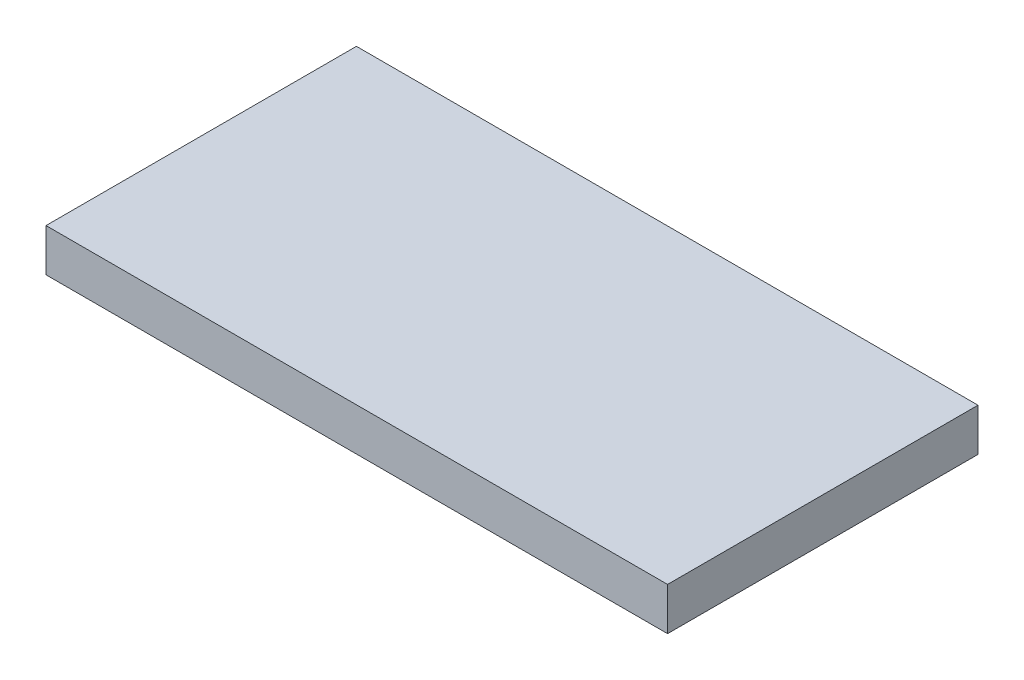
ISO-10303-21;
HEADER;
FILE_DESCRIPTION(('STEP AP214'),'2;1');
FILE_NAME('part.step','',(''),(''),'','','');
FILE_SCHEMA(('AUTOMOTIVE_DESIGN { 1 0 10303 214 1 1 1 1 }'));
ENDSEC;
DATA;
#1=APPLICATION_CONTEXT('core data for automotive mechanical design processes');
#2=APPLICATION_PROTOCOL_DEFINITION('international standard','automotive_design',2000,#1);
#3=PRODUCT_CONTEXT('',#1,'mechanical');
#4=PRODUCT('Part','Part','',(#3));
#5=PRODUCT_RELATED_PRODUCT_CATEGORY('part','',(#4));
#6=PRODUCT_DEFINITION_FORMATION('','',#4);
#7=PRODUCT_DEFINITION_CONTEXT('part definition',#1,'design');
#8=PRODUCT_DEFINITION('design','',#6,#7);
#9=PRODUCT_DEFINITION_SHAPE('','',#8);
#10=(LENGTH_UNIT() NAMED_UNIT(*) SI_UNIT(.MILLI.,.METRE.));
#11=(NAMED_UNIT(*) PLANE_ANGLE_UNIT() SI_UNIT($,.RADIAN.));
#12=(NAMED_UNIT(*) SI_UNIT($,.STERADIAN.) SOLID_ANGLE_UNIT());
#13=UNCERTAINTY_MEASURE_WITH_UNIT(LENGTH_MEASURE(1.E-05),#10,'distance_accuracy_value','');
#14=(GEOMETRIC_REPRESENTATION_CONTEXT(3) GLOBAL_UNCERTAINTY_ASSIGNED_CONTEXT((#13)) GLOBAL_UNIT_ASSIGNED_CONTEXT((#10,
#11,#12)) REPRESENTATION_CONTEXT('',''));
#15=CARTESIAN_POINT('',(0.,0.,0.));
#16=DIRECTION('',(0.,0.,1.));
#17=DIRECTION('',(1.,0.,0.));
#18=AXIS2_PLACEMENT_3D('',#15,#16,#17);
#19=CARTESIAN_POINT('',(0.,0.,0.));
#20=DIRECTION('',(0.,-1.,0.));
#21=DIRECTION('',(0.,0.,-1.));
#22=AXIS2_PLACEMENT_3D('',#19,#20,#21);
#23=PLANE('',#22);
#24=CARTESIAN_POINT('',(8.28039999999996,0.,-17.8562));
#25=DIRECTION('',(0.,-1.,0.));
#26=DIRECTION('',(0.,0.,-1.));
#27=AXIS2_PLACEMENT_3D('',#24,#25,#26);
#28=CIRCLE('',#27,1.0668);
#29=CARTESIAN_POINT('',(8.28039999999996,0.,-18.923));
#30=VERTEX_POINT('',#29);
#31=EDGE_CURVE('E494',#30,#30,#28,.T.);
#32=ORIENTED_EDGE('',*,*,#31,.F.);
#33=EDGE_LOOP('',(#32));
#34=FACE_BOUND('',#33,.T.);
#35=CARTESIAN_POINT('',(179.3875,0.,-10.16));
#36=DIRECTION('',(0.,-1.,0.));
#37=DIRECTION('',(0.,0.,-1.));
#38=AXIS2_PLACEMENT_3D('',#35,#36,#37);
#39=CIRCLE('',#38,1.27000000000003);
#40=CARTESIAN_POINT('',(179.3875,0.,-11.43));
#41=VERTEX_POINT('',#40);
#42=EDGE_CURVE('E284',#41,#41,#39,.T.);
#43=ORIENTED_EDGE('',*,*,#42,.F.);
#44=EDGE_LOOP('',(#43));
#45=FACE_BOUND('',#44,.T.);
#46=CARTESIAN_POINT('',(179.3875,0.,-85.7758));
#47=DIRECTION('',(0.,-1.,0.));
#48=DIRECTION('',(0.,0.,1.));
#49=AXIS2_PLACEMENT_3D('',#46,#47,#48);
#50=CIRCLE('',#49,1.27000000000001);
#51=CARTESIAN_POINT('',(179.3875,0.,-84.5058));
#52=VERTEX_POINT('',#51);
#53=EDGE_CURVE('E288',#52,#52,#50,.T.);
#54=ORIENTED_EDGE('',*,*,#53,.F.);
#55=EDGE_LOOP('',(#54));
#56=FACE_BOUND('',#55,.T.);
#57=CARTESIAN_POINT('',(12.7,0.,-10.16));
#58=DIRECTION('',(0.,-1.,0.));
#59=DIRECTION('',(0.,0.,1.));
#60=AXIS2_PLACEMENT_3D('',#57,#58,#59);
#61=CIRCLE('',#60,1.27000000000001);
#62=CARTESIAN_POINT('',(12.7,0.,-8.88999999999999));
#63=VERTEX_POINT('',#62);
#64=EDGE_CURVE('E294',#63,#63,#61,.T.);
#65=ORIENTED_EDGE('',*,*,#64,.F.);
#66=EDGE_LOOP('',(#65));
#67=FACE_BOUND('',#66,.T.);
#68=CARTESIAN_POINT('',(12.7,0.,-85.7758));
#69=DIRECTION('',(0.,-1.,0.));
#70=DIRECTION('',(0.,0.,-1.));
#71=AXIS2_PLACEMENT_3D('',#68,#69,#70);
#72=CIRCLE('',#71,1.27000000000001);
#73=CARTESIAN_POINT('',(12.7,0.,-87.0458));
#74=VERTEX_POINT('',#73);
#75=EDGE_CURVE('E300',#74,#74,#72,.T.);
#76=ORIENTED_EDGE('',*,*,#75,.F.);
#77=EDGE_LOOP('',(#76));
#78=FACE_BOUND('',#77,.T.);
#79=DIRECTION('',(0.,0.,-1.));
#80=VECTOR('',#79,1.);
#81=CARTESIAN_POINT('',(12.954,0.,-12.954));
#82=LINE('',#81,#80);
#83=CARTESIAN_POINT('',(12.954,0.,-18.034));
#84=VERTEX_POINT('',#83);
#85=CARTESIAN_POINT('',(12.954,0.,-77.9018));
#86=VERTEX_POINT('',#85);
#87=EDGE_CURVE('E306',#84,#86,#82,.T.);
#88=ORIENTED_EDGE('',*,*,#87,.F.);
#89=CARTESIAN_POINT('',(18.034,0.,-18.034));
#90=DIRECTION('',(0.,-1.,0.));
#91=DIRECTION('',(0.,0.,-1.));
#92=AXIS2_PLACEMENT_3D('',#89,#90,#91);
#93=CIRCLE('',#92,5.08);
#94=CARTESIAN_POINT('',(18.034,0.,-12.954));
#95=VERTEX_POINT('',#94);
#96=EDGE_CURVE('E56',#84,#95,#93,.F.);
#97=ORIENTED_EDGE('',*,*,#96,.T.);
#98=DIRECTION('',(-1.,0.,0.));
#99=VECTOR('',#98,1.);
#100=CARTESIAN_POINT('',(12.954,0.,-12.954));
#101=LINE('',#100,#99);
#102=CARTESIAN_POINT('',(174.0535,0.,-12.954));
#103=VERTEX_POINT('',#102);
#104=EDGE_CURVE('E313',#103,#95,#101,.T.);
#105=ORIENTED_EDGE('',*,*,#104,.F.);
#106=CARTESIAN_POINT('',(174.0535,0.,-18.034));
#107=DIRECTION('',(0.,-1.,0.));
#108=DIRECTION('',(0.,0.,-1.));
#109=AXIS2_PLACEMENT_3D('',#106,#107,#108);
#110=CIRCLE('',#109,5.08);
#111=CARTESIAN_POINT('',(179.1335,0.,-18.034));
#112=VERTEX_POINT('',#111);
#113=EDGE_CURVE('E388',#103,#112,#110,.F.);
#114=ORIENTED_EDGE('',*,*,#113,.T.);
#115=DIRECTION('',(0.,0.,1.));
#116=VECTOR('',#115,1.);
#117=CARTESIAN_POINT('',(179.1335,0.,-12.954));
#118=LINE('',#117,#116);
#119=CARTESIAN_POINT('',(179.1335,0.,-77.9018));
#120=VERTEX_POINT('',#119);
#121=EDGE_CURVE('E327',#120,#112,#118,.T.);
#122=ORIENTED_EDGE('',*,*,#121,.F.);
#123=CARTESIAN_POINT('',(174.0535,0.,-77.9018));
#124=DIRECTION('',(0.,-1.,0.));
#125=DIRECTION('',(0.,0.,-1.));
#126=AXIS2_PLACEMENT_3D('',#123,#124,#125);
#127=CIRCLE('',#126,5.08);
#128=CARTESIAN_POINT('',(174.0535,0.,-82.9818));
#129=VERTEX_POINT('',#128);
#130=EDGE_CURVE('E390',#120,#129,#127,.F.);
#131=ORIENTED_EDGE('',*,*,#130,.T.);
#132=DIRECTION('',(1.,0.,0.));
#133=VECTOR('',#132,1.);
#134=CARTESIAN_POINT('',(12.954,0.,-82.9818));
#135=LINE('',#134,#133);
#136=CARTESIAN_POINT('',(18.034,0.,-82.9818));
#137=VERTEX_POINT('',#136);
#138=EDGE_CURVE('E324',#137,#129,#135,.T.);
#139=ORIENTED_EDGE('',*,*,#138,.F.);
#140=CARTESIAN_POINT('',(18.034,0.,-77.9018));
#141=DIRECTION('',(0.,-1.,0.));
#142=DIRECTION('',(0.,0.,-1.));
#143=AXIS2_PLACEMENT_3D('',#140,#141,#142);
#144=CIRCLE('',#143,5.08);
#145=EDGE_CURVE('E48',#137,#86,#144,.F.);
#146=ORIENTED_EDGE('',*,*,#145,.T.);
#147=EDGE_LOOP('',(#88,#97,#105,#114,#122,#131,#139,#146));
#148=FACE_BOUND('',#147,.T.);
#149=DIRECTION('',(0.,0.,1.));
#150=VECTOR('',#149,1.);
#151=CARTESIAN_POINT('',(0.,0.,0.));
#152=LINE('',#151,#150);
#153=CARTESIAN_POINT('',(0.,0.,-95.9358));
#154=VERTEX_POINT('',#153);
#155=CARTESIAN_POINT('',(0.,0.,0.));
#156=VERTEX_POINT('',#155);
#157=EDGE_CURVE('E322',#154,#156,#152,.T.);
#158=ORIENTED_EDGE('',*,*,#157,.F.);
#159=DIRECTION('',(-1.,0.,0.));
#160=VECTOR('',#159,1.);
#161=CARTESIAN_POINT('',(0.,0.,-95.9358));
#162=LINE('',#161,#160);
#163=CARTESIAN_POINT('',(192.0875,0.,-95.9358));
#164=VERTEX_POINT('',#163);
#165=EDGE_CURVE('E336',#164,#154,#162,.T.);
#166=ORIENTED_EDGE('',*,*,#165,.F.);
#167=DIRECTION('',(0.,0.,-1.));
#168=VECTOR('',#167,1.);
#169=CARTESIAN_POINT('',(192.0875,0.,0.));
#170=LINE('',#169,#168);
#171=CARTESIAN_POINT('',(192.0875,0.,0.));
#172=VERTEX_POINT('',#171);
#173=EDGE_CURVE('E347',#172,#164,#170,.T.);
#174=ORIENTED_EDGE('',*,*,#173,.F.);
#175=DIRECTION('',(1.,0.,0.));
#176=VECTOR('',#175,1.);
#177=CARTESIAN_POINT('',(0.,0.,0.));
#178=LINE('',#177,#176);
#179=EDGE_CURVE('E345',#156,#172,#178,.T.);
#180=ORIENTED_EDGE('',*,*,#179,.F.);
#181=EDGE_LOOP('',(#158,#166,#174,#180));
#182=FACE_BOUND('',#181,.T.);
#183=CARTESIAN_POINT('',(183.8071,0.,-78.0796));
#184=DIRECTION('',(0.,-1.,0.));
#185=DIRECTION('',(0.,0.,-1.));
#186=AXIS2_PLACEMENT_3D('',#183,#184,#185);
#187=CIRCLE('',#186,1.06680000000001);
#188=CARTESIAN_POINT('',(183.8071,0.,-79.1464));
#189=VERTEX_POINT('',#188);
#190=EDGE_CURVE('E492',#189,#189,#187,.T.);
#191=ORIENTED_EDGE('',*,*,#190,.F.);
#192=EDGE_LOOP('',(#191));
#193=FACE_BOUND('',#192,.T.);
#194=ADVANCED_FACE('F33',(#34,#45,#56,#67,#78,#148,#182,#193),#23,.T.);
#195=CARTESIAN_POINT('',(0.,7.874,0.));
#196=DIRECTION('',(0.,-1.,0.));
#197=DIRECTION('',(0.,0.,-1.));
#198=AXIS2_PLACEMENT_3D('',#195,#196,#197);
#199=PLANE('',#198);
#200=DIRECTION('',(1.,0.,0.));
#201=VECTOR('',#200,1.);
#202=CARTESIAN_POINT('',(16.8148,7.874,-62.357));
#203=LINE('',#202,#201);
#204=CARTESIAN_POINT('',(16.8148,7.874,-62.357));
#205=VERTEX_POINT('',#204);
#206=CARTESIAN_POINT('',(25.7048,7.874,-62.357));
#207=VERTEX_POINT('',#206);
#208=EDGE_CURVE('E224',#205,#207,#203,.T.);
#209=ORIENTED_EDGE('',*,*,#208,.F.);
#210=DIRECTION('',(0.,0.,-1.));
#211=VECTOR('',#210,1.);
#212=CARTESIAN_POINT('',(16.8148,7.874,-34.417));
#213=LINE('',#212,#211);
#214=CARTESIAN_POINT('',(16.8148,7.874,-34.417));
#215=VERTEX_POINT('',#214);
#216=EDGE_CURVE('E221',#215,#205,#213,.T.);
#217=ORIENTED_EDGE('',*,*,#216,.F.);
#218=DIRECTION('',(-1.,0.,0.));
#219=VECTOR('',#218,1.);
#220=CARTESIAN_POINT('',(16.8148,7.874,-34.417));
#221=LINE('',#220,#219);
#222=CARTESIAN_POINT('',(25.7048,7.874,-34.417));
#223=VERTEX_POINT('',#222);
#224=EDGE_CURVE('E234',#223,#215,#221,.T.);
#225=ORIENTED_EDGE('',*,*,#224,.F.);
#226=DIRECTION('',(0.,0.,1.));
#227=VECTOR('',#226,1.);
#228=CARTESIAN_POINT('',(25.7048,7.874,-34.417));
#229=LINE('',#228,#227);
#230=EDGE_CURVE('E242',#207,#223,#229,.T.);
#231=ORIENTED_EDGE('',*,*,#230,.F.);
#232=EDGE_LOOP('',(#209,#217,#225,#231));
#233=FACE_BOUND('',#232,.T.);
#234=DIRECTION('',(0.,0.,1.));
#235=VECTOR('',#234,1.);
#236=CARTESIAN_POINT('',(179.1335,7.874,-12.954));
#237=LINE('',#236,#235);
#238=CARTESIAN_POINT('',(179.1335,7.874,-77.9018));
#239=VERTEX_POINT('',#238);
#240=CARTESIAN_POINT('',(179.1335,7.874,-18.034));
#241=VERTEX_POINT('',#240);
#242=EDGE_CURVE('E316',#239,#241,#237,.T.);
#243=ORIENTED_EDGE('',*,*,#242,.T.);
#244=CARTESIAN_POINT('',(174.0535,7.874,-18.034));
#245=DIRECTION('',(0.,-1.,0.));
#246=DIRECTION('',(0.,0.,-1.));
#247=AXIS2_PLACEMENT_3D('',#244,#245,#246);
#248=CIRCLE('',#247,5.08);
#249=CARTESIAN_POINT('',(174.0535,7.874,-12.954));
#250=VERTEX_POINT('',#249);
#251=EDGE_CURVE('E377',#241,#250,#248,.T.);
#252=ORIENTED_EDGE('',*,*,#251,.T.);
#253=DIRECTION('',(-1.,0.,0.));
#254=VECTOR('',#253,1.);
#255=CARTESIAN_POINT('',(12.954,7.874,-12.954));
#256=LINE('',#255,#254);
#257=CARTESIAN_POINT('',(18.034,7.874,-12.954));
#258=VERTEX_POINT('',#257);
#259=EDGE_CURVE('E319',#250,#258,#256,.T.);
#260=ORIENTED_EDGE('',*,*,#259,.T.);
#261=CARTESIAN_POINT('',(18.034,7.874,-18.034));
#262=DIRECTION('',(0.,-1.,0.));
#263=DIRECTION('',(0.,0.,-1.));
#264=AXIS2_PLACEMENT_3D('',#261,#262,#263);
#265=CIRCLE('',#264,5.08);
#266=CARTESIAN_POINT('',(12.954,7.874,-18.034));
#267=VERTEX_POINT('',#266);
#268=EDGE_CURVE('E371',#258,#267,#265,.T.);
#269=ORIENTED_EDGE('',*,*,#268,.T.);
#270=DIRECTION('',(0.,0.,-1.));
#271=VECTOR('',#270,1.);
#272=CARTESIAN_POINT('',(12.954,7.874,-12.954));
#273=LINE('',#272,#271);
#274=CARTESIAN_POINT('',(12.954,7.874,-77.9018));
#275=VERTEX_POINT('',#274);
#276=EDGE_CURVE('E309',#267,#275,#273,.T.);
#277=ORIENTED_EDGE('',*,*,#276,.T.);
#278=CARTESIAN_POINT('',(18.034,7.874,-77.9018));
#279=DIRECTION('',(0.,-1.,0.));
#280=DIRECTION('',(0.,0.,-1.));
#281=AXIS2_PLACEMENT_3D('',#278,#279,#280);
#282=CIRCLE('',#281,5.08);
#283=CARTESIAN_POINT('',(18.034,7.874,-82.9818));
#284=VERTEX_POINT('',#283);
#285=EDGE_CURVE('E373',#275,#284,#282,.T.);
#286=ORIENTED_EDGE('',*,*,#285,.T.);
#287=DIRECTION('',(1.,0.,0.));
#288=VECTOR('',#287,1.);
#289=CARTESIAN_POINT('',(12.954,7.874,-82.9818));
#290=LINE('',#289,#288);
#291=CARTESIAN_POINT('',(174.0535,7.874,-82.9818));
#292=VERTEX_POINT('',#291);
#293=EDGE_CURVE('E312',#284,#292,#290,.T.);
#294=ORIENTED_EDGE('',*,*,#293,.T.);
#295=CARTESIAN_POINT('',(174.0535,7.874,-77.9018));
#296=DIRECTION('',(0.,-1.,0.));
#297=DIRECTION('',(0.,0.,-1.));
#298=AXIS2_PLACEMENT_3D('',#295,#296,#297);
#299=CIRCLE('',#298,5.08);
#300=EDGE_CURVE('E375',#292,#239,#299,.T.);
#301=ORIENTED_EDGE('',*,*,#300,.T.);
#302=EDGE_LOOP('',(#243,#252,#260,#269,#277,#286,#294,#301));
#303=FACE_BOUND('',#302,.T.);
#304=DIRECTION('',(1.,0.,0.));
#305=VECTOR('',#304,1.);
#306=CARTESIAN_POINT('',(66.294,7.874,-53.9496));
#307=LINE('',#306,#305);
#308=CARTESIAN_POINT('',(66.294,7.874,-53.9496));
#309=VERTEX_POINT('',#308);
#310=CARTESIAN_POINT('',(82.0928,7.874,-53.9496));
#311=VERTEX_POINT('',#310);
#312=EDGE_CURVE('E269',#309,#311,#307,.T.);
#313=ORIENTED_EDGE('',*,*,#312,.F.);
#314=DIRECTION('',(0.,0.,-1.));
#315=VECTOR('',#314,1.);
#316=CARTESIAN_POINT('',(66.294,7.874,-45.6692));
#317=LINE('',#316,#315);
#318=CARTESIAN_POINT('',(66.294,7.874,-45.6692));
#319=VERTEX_POINT('',#318);
#320=EDGE_CURVE('E255',#319,#309,#317,.T.);
#321=ORIENTED_EDGE('',*,*,#320,.F.);
#322=DIRECTION('',(-1.,0.,0.));
#323=VECTOR('',#322,1.);
#324=CARTESIAN_POINT('',(66.294,7.874,-45.6692));
#325=LINE('',#324,#323);
#326=CARTESIAN_POINT('',(82.0928,7.874,-45.6692));
#327=VERTEX_POINT('',#326);
#328=EDGE_CURVE('E260',#327,#319,#325,.T.);
#329=ORIENTED_EDGE('',*,*,#328,.F.);
#330=DIRECTION('',(0.,0.,1.));
#331=VECTOR('',#330,1.);
#332=CARTESIAN_POINT('',(82.0928,7.874,-45.6692));
#333=LINE('',#332,#331);
#334=EDGE_CURVE('E271',#311,#327,#333,.T.);
#335=ORIENTED_EDGE('',*,*,#334,.F.);
#336=EDGE_LOOP('',(#313,#321,#329,#335));
#337=FACE_BOUND('',#336,.T.);
#338=DIRECTION('',(-1.,0.,0.));
#339=VECTOR('',#338,1.);
#340=CARTESIAN_POINT('',(175.2727,7.874,-34.417));
#341=LINE('',#340,#339);
#342=CARTESIAN_POINT('',(175.2727,7.874,-34.417));
#343=VERTEX_POINT('',#342);
#344=CARTESIAN_POINT('',(166.3827,7.874,-34.417));
#345=VERTEX_POINT('',#344);
#346=EDGE_CURVE('E503',#343,#345,#341,.T.);
#347=ORIENTED_EDGE('',*,*,#346,.F.);
#348=DIRECTION('',(0.,0.,1.));
#349=VECTOR('',#348,1.);
#350=CARTESIAN_POINT('',(175.2727,7.874,-34.417));
#351=LINE('',#350,#349);
#352=CARTESIAN_POINT('',(175.2727,7.874,-62.357));
#353=VERTEX_POINT('',#352);
#354=EDGE_CURVE('E219',#353,#343,#351,.T.);
#355=ORIENTED_EDGE('',*,*,#354,.F.);
#356=DIRECTION('',(1.,0.,0.));
#357=VECTOR('',#356,1.);
#358=CARTESIAN_POINT('',(175.2727,7.874,-62.357));
#359=LINE('',#358,#357);
#360=CARTESIAN_POINT('',(166.3827,7.874,-62.357));
#361=VERTEX_POINT('',#360);
#362=EDGE_CURVE('E215',#361,#353,#359,.T.);
#363=ORIENTED_EDGE('',*,*,#362,.F.);
#364=DIRECTION('',(0.,0.,-1.));
#365=VECTOR('',#364,1.);
#366=CARTESIAN_POINT('',(166.3827,7.874,-34.417));
#367=LINE('',#366,#365);
#368=EDGE_CURVE('E505',#345,#361,#367,.T.);
#369=ORIENTED_EDGE('',*,*,#368,.F.);
#370=EDGE_LOOP('',(#347,#355,#363,#369));
#371=FACE_BOUND('',#370,.T.);
#372=ADVANCED_FACE('F414',(#233,#303,#337,#371),#199,.T.);
#373=CARTESIAN_POINT('',(0.,13.1826,0.));
#374=DIRECTION('',(1.,0.,0.));
#375=DIRECTION('',(0.,0.,-1.));
#376=AXIS2_PLACEMENT_3D('',#373,#374,#375);
#377=PLANE('',#376);
#378=ORIENTED_EDGE('',*,*,#157,.T.);
#379=DIRECTION('',(0.,-1.,0.));
#380=VECTOR('',#379,1.);
#381=CARTESIAN_POINT('',(0.,13.1826,0.));
#382=LINE('',#381,#380);
#383=CARTESIAN_POINT('',(0.,13.1826,0.));
#384=VERTEX_POINT('',#383);
#385=EDGE_CURVE('E358',#384,#156,#382,.T.);
#386=ORIENTED_EDGE('',*,*,#385,.F.);
#387=DIRECTION('',(0.,0.,1.));
#388=VECTOR('',#387,1.);
#389=CARTESIAN_POINT('',(0.,13.1826,0.));
#390=LINE('',#389,#388);
#391=CARTESIAN_POINT('',(0.,13.1826,-95.9358));
#392=VERTEX_POINT('',#391);
#393=EDGE_CURVE('E332',#392,#384,#390,.T.);
#394=ORIENTED_EDGE('',*,*,#393,.F.);
#395=DIRECTION('',(0.,-1.,0.));
#396=VECTOR('',#395,1.);
#397=CARTESIAN_POINT('',(0.,13.1826,-95.9358));
#398=LINE('',#397,#396);
#399=EDGE_CURVE('E342',#392,#154,#398,.T.);
#400=ORIENTED_EDGE('',*,*,#399,.T.);
#401=EDGE_LOOP('',(#378,#386,#394,#400));
#402=FACE_BOUND('',#401,.T.);
#403=ADVANCED_FACE('F420',(#402),#377,.F.);
#404=CARTESIAN_POINT('',(0.,13.1826,0.));
#405=DIRECTION('',(0.,0.,-1.));
#406=DIRECTION('',(-1.,0.,0.));
#407=AXIS2_PLACEMENT_3D('',#404,#405,#406);
#408=PLANE('',#407);
#409=ORIENTED_EDGE('',*,*,#179,.T.);
#410=DIRECTION('',(0.,-1.,0.));
#411=VECTOR('',#410,1.);
#412=CARTESIAN_POINT('',(192.0875,13.1826,0.));
#413=LINE('',#412,#411);
#414=CARTESIAN_POINT('',(192.0875,13.1826,0.));
#415=VERTEX_POINT('',#414);
#416=EDGE_CURVE('E355',#415,#172,#413,.T.);
#417=ORIENTED_EDGE('',*,*,#416,.F.);
#418=DIRECTION('',(1.,0.,0.));
#419=VECTOR('',#418,1.);
#420=CARTESIAN_POINT('',(0.,13.1826,0.));
#421=LINE('',#420,#419);
#422=EDGE_CURVE('E335',#384,#415,#421,.T.);
#423=ORIENTED_EDGE('',*,*,#422,.F.);
#424=ORIENTED_EDGE('',*,*,#385,.T.);
#425=EDGE_LOOP('',(#409,#417,#423,#424));
#426=FACE_BOUND('',#425,.T.);
#427=ADVANCED_FACE('F436',(#426),#408,.F.);
#428=CARTESIAN_POINT('',(192.0875,13.1826,0.));
#429=DIRECTION('',(-1.,0.,0.));
#430=DIRECTION('',(0.,0.,1.));
#431=AXIS2_PLACEMENT_3D('',#428,#429,#430);
#432=PLANE('',#431);
#433=ORIENTED_EDGE('',*,*,#173,.T.);
#434=DIRECTION('',(0.,-1.,0.));
#435=VECTOR('',#434,1.);
#436=CARTESIAN_POINT('',(192.0875,13.1826,-95.9358));
#437=LINE('',#436,#435);
#438=CARTESIAN_POINT('',(192.0875,13.1826,-95.9358));
#439=VERTEX_POINT('',#438);
#440=EDGE_CURVE('E352',#439,#164,#437,.T.);
#441=ORIENTED_EDGE('',*,*,#440,.F.);
#442=DIRECTION('',(0.,0.,-1.));
#443=VECTOR('',#442,1.);
#444=CARTESIAN_POINT('',(192.0875,13.1826,0.));
#445=LINE('',#444,#443);
#446=EDGE_CURVE('E338',#415,#439,#445,.T.);
#447=ORIENTED_EDGE('',*,*,#446,.F.);
#448=ORIENTED_EDGE('',*,*,#416,.T.);
#449=EDGE_LOOP('',(#433,#441,#447,#448));
#450=FACE_BOUND('',#449,.T.);
#451=ADVANCED_FACE('F432',(#450),#432,.F.);
#452=CARTESIAN_POINT('',(0.,13.1826,-95.9358));
#453=DIRECTION('',(0.,0.,1.));
#454=DIRECTION('',(1.,0.,0.));
#455=AXIS2_PLACEMENT_3D('',#452,#453,#454);
#456=PLANE('',#455);
#457=ORIENTED_EDGE('',*,*,#165,.T.);
#458=ORIENTED_EDGE('',*,*,#399,.F.);
#459=DIRECTION('',(-1.,0.,0.));
#460=VECTOR('',#459,1.);
#461=CARTESIAN_POINT('',(0.,13.1826,-95.9358));
#462=LINE('',#461,#460);
#463=EDGE_CURVE('E340',#439,#392,#462,.T.);
#464=ORIENTED_EDGE('',*,*,#463,.F.);
#465=ORIENTED_EDGE('',*,*,#440,.T.);
#466=EDGE_LOOP('',(#457,#458,#464,#465));
#467=FACE_BOUND('',#466,.T.);
#468=ADVANCED_FACE('F429',(#467),#456,.F.);
#469=CARTESIAN_POINT('',(0.,13.1826,0.));
#470=DIRECTION('',(0.,-1.,0.));
#471=DIRECTION('',(0.,0.,-1.));
#472=AXIS2_PLACEMENT_3D('',#469,#470,#471);
#473=PLANE('',#472);
#474=ORIENTED_EDGE('',*,*,#393,.T.);
#475=ORIENTED_EDGE('',*,*,#422,.T.);
#476=ORIENTED_EDGE('',*,*,#446,.T.);
#477=ORIENTED_EDGE('',*,*,#463,.T.);
#478=EDGE_LOOP('',(#474,#475,#476,#477));
#479=FACE_BOUND('',#478,.T.);
#480=ADVANCED_FACE('F427',(#479),#473,.F.);
#481=CARTESIAN_POINT('',(12.954,7.874,-12.954));
#482=DIRECTION('',(-1.,0.,0.));
#483=DIRECTION('',(0.,0.,1.));
#484=AXIS2_PLACEMENT_3D('',#481,#482,#483);
#485=PLANE('',#484);
#486=ORIENTED_EDGE('',*,*,#87,.T.);
#487=DIRECTION('',(0.,-1.,0.));
#488=VECTOR('',#487,1.);
#489=CARTESIAN_POINT('',(12.954,7.874,-77.9018));
#490=LINE('',#489,#488);
#491=EDGE_CURVE('E386',#86,#275,#490,.F.);
#492=ORIENTED_EDGE('',*,*,#491,.T.);
#493=ORIENTED_EDGE('',*,*,#276,.F.);
#494=DIRECTION('',(0.,-1.,0.));
#495=VECTOR('',#494,1.);
#496=CARTESIAN_POINT('',(12.954,0.,-18.034));
#497=LINE('',#496,#495);
#498=EDGE_CURVE('E384',#267,#84,#497,.T.);
#499=ORIENTED_EDGE('',*,*,#498,.T.);
#500=EDGE_LOOP('',(#486,#492,#493,#499));
#501=FACE_BOUND('',#500,.T.);
#502=ADVANCED_FACE('F467',(#501),#485,.F.);
#503=CARTESIAN_POINT('',(12.954,7.874,-12.954));
#504=DIRECTION('',(0.,0.,1.));
#505=DIRECTION('',(1.,0.,0.));
#506=AXIS2_PLACEMENT_3D('',#503,#504,#505);
#507=PLANE('',#506);
#508=ORIENTED_EDGE('',*,*,#259,.F.);
#509=DIRECTION('',(0.,-1.,0.));
#510=VECTOR('',#509,1.);
#511=CARTESIAN_POINT('',(174.0535,0.,-12.954));
#512=LINE('',#511,#510);
#513=EDGE_CURVE('E363',#250,#103,#512,.T.);
#514=ORIENTED_EDGE('',*,*,#513,.T.);
#515=ORIENTED_EDGE('',*,*,#104,.T.);
#516=DIRECTION('',(0.,-1.,0.));
#517=VECTOR('',#516,1.);
#518=CARTESIAN_POINT('',(18.034,7.874,-12.954));
#519=LINE('',#518,#517);
#520=EDGE_CURVE('E361',#95,#258,#519,.F.);
#521=ORIENTED_EDGE('',*,*,#520,.T.);
#522=EDGE_LOOP('',(#508,#514,#515,#521));
#523=FACE_BOUND('',#522,.T.);
#524=ADVANCED_FACE('F484',(#523),#507,.F.);
#525=CARTESIAN_POINT('',(179.1335,7.874,-12.954));
#526=DIRECTION('',(1.,0.,0.));
#527=DIRECTION('',(0.,0.,-1.));
#528=AXIS2_PLACEMENT_3D('',#525,#526,#527);
#529=PLANE('',#528);
#530=ORIENTED_EDGE('',*,*,#121,.T.);
#531=DIRECTION('',(0.,-1.,0.));
#532=VECTOR('',#531,1.);
#533=CARTESIAN_POINT('',(179.1335,7.874,-18.034));
#534=LINE('',#533,#532);
#535=EDGE_CURVE('E369',#112,#241,#534,.F.);
#536=ORIENTED_EDGE('',*,*,#535,.T.);
#537=ORIENTED_EDGE('',*,*,#242,.F.);
#538=DIRECTION('',(0.,-1.,0.));
#539=VECTOR('',#538,1.);
#540=CARTESIAN_POINT('',(179.1335,0.,-77.9018));
#541=LINE('',#540,#539);
#542=EDGE_CURVE('E366',#239,#120,#541,.T.);
#543=ORIENTED_EDGE('',*,*,#542,.T.);
#544=EDGE_LOOP('',(#530,#536,#537,#543));
#545=FACE_BOUND('',#544,.T.);
#546=ADVANCED_FACE('F479',(#545),#529,.F.);
#547=CARTESIAN_POINT('',(12.954,7.874,-82.9818));
#548=DIRECTION('',(0.,0.,-1.));
#549=DIRECTION('',(-1.,0.,0.));
#550=AXIS2_PLACEMENT_3D('',#547,#548,#549);
#551=PLANE('',#550);
#552=ORIENTED_EDGE('',*,*,#138,.T.);
#553=DIRECTION('',(0.,-1.,0.));
#554=VECTOR('',#553,1.);
#555=CARTESIAN_POINT('',(174.0535,7.874,-82.9818));
#556=LINE('',#555,#554);
#557=EDGE_CURVE('E382',#129,#292,#556,.F.);
#558=ORIENTED_EDGE('',*,*,#557,.T.);
#559=ORIENTED_EDGE('',*,*,#293,.F.);
#560=DIRECTION('',(0.,-1.,0.));
#561=VECTOR('',#560,1.);
#562=CARTESIAN_POINT('',(18.034,0.,-82.9818));
#563=LINE('',#562,#561);
#564=EDGE_CURVE('E379',#284,#137,#563,.T.);
#565=ORIENTED_EDGE('',*,*,#564,.T.);
#566=EDGE_LOOP('',(#552,#558,#559,#565));
#567=FACE_BOUND('',#566,.T.);
#568=ADVANCED_FACE('F473',(#567),#551,.F.);
#569=CARTESIAN_POINT('',(12.7,7.874,-85.7758));
#570=DIRECTION('',(0.,-1.,0.));
#571=DIRECTION('',(0.,0.,-1.));
#572=AXIS2_PLACEMENT_3D('',#569,#570,#571);
#573=CYLINDRICAL_SURFACE('',#572,1.27000000000001);
#574=CARTESIAN_POINT('',(12.7,7.874,-85.7758));
#575=DIRECTION('',(0.,-1.,0.));
#576=DIRECTION('',(0.,0.,-1.));
#577=AXIS2_PLACEMENT_3D('',#574,#575,#576);
#578=CIRCLE('',#577,1.27000000000001);
#579=CARTESIAN_POINT('',(12.7,7.874,-87.0458));
#580=VERTEX_POINT('',#579);
#581=EDGE_CURVE('E303',#580,#580,#578,.T.);
#582=ORIENTED_EDGE('',*,*,#581,.F.);
#583=EDGE_LOOP('',(#582));
#584=FACE_BOUND('',#583,.T.);
#585=ORIENTED_EDGE('',*,*,#75,.T.);
#586=EDGE_LOOP('',(#585));
#587=FACE_BOUND('',#586,.T.);
#588=ADVANCED_FACE('F596',(#584,#587),#573,.F.);
#589=CARTESIAN_POINT('',(12.7,7.874,-85.7758));
#590=DIRECTION('',(0.,-1.,0.));
#591=DIRECTION('',(0.,0.,-1.));
#592=AXIS2_PLACEMENT_3D('',#589,#590,#591);
#593=PLANE('',#592);
#594=ORIENTED_EDGE('',*,*,#581,.T.);
#595=EDGE_LOOP('',(#594));
#596=FACE_BOUND('',#595,.T.);
#597=ADVANCED_FACE('F592',(#596),#593,.T.);
#598=CARTESIAN_POINT('',(12.7,7.874,-10.16));
#599=DIRECTION('',(0.,-1.,0.));
#600=DIRECTION('',(0.,0.,-1.));
#601=AXIS2_PLACEMENT_3D('',#598,#599,#600);
#602=CYLINDRICAL_SURFACE('',#601,1.27000000000001);
#603=CARTESIAN_POINT('',(12.7,7.874,-10.16));
#604=DIRECTION('',(0.,-1.,0.));
#605=DIRECTION('',(0.,0.,1.));
#606=AXIS2_PLACEMENT_3D('',#603,#604,#605);
#607=CIRCLE('',#606,1.27000000000001);
#608=CARTESIAN_POINT('',(12.7,7.874,-8.88999999999999));
#609=VERTEX_POINT('',#608);
#610=EDGE_CURVE('E297',#609,#609,#607,.T.);
#611=ORIENTED_EDGE('',*,*,#610,.F.);
#612=EDGE_LOOP('',(#611));
#613=FACE_BOUND('',#612,.T.);
#614=ORIENTED_EDGE('',*,*,#64,.T.);
#615=EDGE_LOOP('',(#614));
#616=FACE_BOUND('',#615,.T.);
#617=ADVANCED_FACE('F588',(#613,#616),#602,.F.);
#618=CARTESIAN_POINT('',(12.7,7.874,-10.16));
#619=DIRECTION('',(0.,1.,0.));
#620=DIRECTION('',(0.,0.,1.));
#621=AXIS2_PLACEMENT_3D('',#618,#619,#620);
#622=PLANE('',#621);
#623=ORIENTED_EDGE('',*,*,#610,.T.);
#624=EDGE_LOOP('',(#623));
#625=FACE_BOUND('',#624,.T.);
#626=ADVANCED_FACE('F584',(#625),#622,.F.);
#627=CARTESIAN_POINT('',(179.3875,7.874,-85.7758));
#628=DIRECTION('',(0.,-1.,0.));
#629=DIRECTION('',(0.,0.,-1.));
#630=AXIS2_PLACEMENT_3D('',#627,#628,#629);
#631=CYLINDRICAL_SURFACE('',#630,1.27000000000001);
#632=CARTESIAN_POINT('',(179.3875,7.874,-85.7758));
#633=DIRECTION('',(0.,-1.,0.));
#634=DIRECTION('',(0.,0.,1.));
#635=AXIS2_PLACEMENT_3D('',#632,#633,#634);
#636=CIRCLE('',#635,1.27000000000001);
#637=CARTESIAN_POINT('',(179.3875,7.874,-84.5058));
#638=VERTEX_POINT('',#637);
#639=EDGE_CURVE('E291',#638,#638,#636,.T.);
#640=ORIENTED_EDGE('',*,*,#639,.F.);
#641=EDGE_LOOP('',(#640));
#642=FACE_BOUND('',#641,.T.);
#643=ORIENTED_EDGE('',*,*,#53,.T.);
#644=EDGE_LOOP('',(#643));
#645=FACE_BOUND('',#644,.T.);
#646=ADVANCED_FACE('F580',(#642,#645),#631,.F.);
#647=CARTESIAN_POINT('',(179.3875,7.874,-85.7758));
#648=DIRECTION('',(0.,1.,0.));
#649=DIRECTION('',(0.,0.,1.));
#650=AXIS2_PLACEMENT_3D('',#647,#648,#649);
#651=PLANE('',#650);
#652=ORIENTED_EDGE('',*,*,#639,.T.);
#653=EDGE_LOOP('',(#652));
#654=FACE_BOUND('',#653,.T.);
#655=ADVANCED_FACE('F576',(#654),#651,.F.);
#656=CARTESIAN_POINT('',(179.3875,7.874,-10.16));
#657=DIRECTION('',(0.,-1.,0.));
#658=DIRECTION('',(0.,0.,-1.));
#659=AXIS2_PLACEMENT_3D('',#656,#657,#658);
#660=CYLINDRICAL_SURFACE('',#659,1.27000000000003);
#661=CARTESIAN_POINT('',(179.3875,7.874,-10.16));
#662=DIRECTION('',(0.,-1.,0.));
#663=DIRECTION('',(0.,0.,-1.));
#664=AXIS2_PLACEMENT_3D('',#661,#662,#663);
#665=CIRCLE('',#664,1.27000000000003);
#666=CARTESIAN_POINT('',(179.3875,7.874,-11.43));
#667=VERTEX_POINT('',#666);
#668=EDGE_CURVE('E285',#667,#667,#665,.T.);
#669=ORIENTED_EDGE('',*,*,#668,.F.);
#670=EDGE_LOOP('',(#669));
#671=FACE_BOUND('',#670,.T.);
#672=ORIENTED_EDGE('',*,*,#42,.T.);
#673=EDGE_LOOP('',(#672));
#674=FACE_BOUND('',#673,.T.);
#675=ADVANCED_FACE('F572',(#671,#674),#660,.F.);
#676=CARTESIAN_POINT('',(179.3875,7.874,-10.16));
#677=DIRECTION('',(0.,-1.,0.));
#678=DIRECTION('',(0.,0.,-1.));
#679=AXIS2_PLACEMENT_3D('',#676,#677,#678);
#680=PLANE('',#679);
#681=ORIENTED_EDGE('',*,*,#668,.T.);
#682=EDGE_LOOP('',(#681));
#683=FACE_BOUND('',#682,.T.);
#684=ADVANCED_FACE('F568',(#683),#680,.T.);
#685=CARTESIAN_POINT('',(66.294,-1.9558,-45.6692));
#686=DIRECTION('',(1.,0.,0.));
#687=DIRECTION('',(0.,0.,-1.));
#688=AXIS2_PLACEMENT_3D('',#685,#686,#687);
#689=PLANE('',#688);
#690=ORIENTED_EDGE('',*,*,#320,.T.);
#691=DIRECTION('',(0.,1.,0.));
#692=VECTOR('',#691,1.);
#693=CARTESIAN_POINT('',(66.294,-1.9558,-53.9496));
#694=LINE('',#693,#692);
#695=CARTESIAN_POINT('',(66.294,-1.9558,-53.9496));
#696=VERTEX_POINT('',#695);
#697=EDGE_CURVE('E282',#696,#309,#694,.T.);
#698=ORIENTED_EDGE('',*,*,#697,.F.);
#699=DIRECTION('',(0.,0.,-1.));
#700=VECTOR('',#699,1.);
#701=CARTESIAN_POINT('',(66.294,-1.9558,-45.6692));
#702=LINE('',#701,#700);
#703=CARTESIAN_POINT('',(66.294,-1.9558,-45.6692));
#704=VERTEX_POINT('',#703);
#705=EDGE_CURVE('E256',#704,#696,#702,.T.);
#706=ORIENTED_EDGE('',*,*,#705,.F.);
#707=DIRECTION('',(0.,1.,0.));
#708=VECTOR('',#707,1.);
#709=CARTESIAN_POINT('',(66.294,-1.9558,-45.6692));
#710=LINE('',#709,#708);
#711=EDGE_CURVE('E266',#704,#319,#710,.T.);
#712=ORIENTED_EDGE('',*,*,#711,.T.);
#713=EDGE_LOOP('',(#690,#698,#706,#712));
#714=FACE_BOUND('',#713,.T.);
#715=ADVANCED_FACE('F564',(#714),#689,.F.);
#716=CARTESIAN_POINT('',(66.294,-1.9558,-53.9496));
#717=DIRECTION('',(0.,0.,1.));
#718=DIRECTION('',(1.,0.,0.));
#719=AXIS2_PLACEMENT_3D('',#716,#717,#718);
#720=PLANE('',#719);
#721=ORIENTED_EDGE('',*,*,#312,.T.);
#722=DIRECTION('',(0.,1.,0.));
#723=VECTOR('',#722,1.);
#724=CARTESIAN_POINT('',(82.0928,-1.9558,-53.9496));
#725=LINE('',#724,#723);
#726=CARTESIAN_POINT('',(82.0928,-1.9558,-53.9496));
#727=VERTEX_POINT('',#726);
#728=EDGE_CURVE('E279',#727,#311,#725,.T.);
#729=ORIENTED_EDGE('',*,*,#728,.F.);
#730=DIRECTION('',(1.,0.,0.));
#731=VECTOR('',#730,1.);
#732=CARTESIAN_POINT('',(66.294,-1.9558,-53.9496));
#733=LINE('',#732,#731);
#734=EDGE_CURVE('E259',#696,#727,#733,.T.);
#735=ORIENTED_EDGE('',*,*,#734,.F.);
#736=ORIENTED_EDGE('',*,*,#697,.T.);
#737=EDGE_LOOP('',(#721,#729,#735,#736));
#738=FACE_BOUND('',#737,.T.);
#739=ADVANCED_FACE('F560',(#738),#720,.F.);
#740=CARTESIAN_POINT('',(82.0928,-1.9558,-45.6692));
#741=DIRECTION('',(-1.,0.,0.));
#742=DIRECTION('',(0.,0.,1.));
#743=AXIS2_PLACEMENT_3D('',#740,#741,#742);
#744=PLANE('',#743);
#745=ORIENTED_EDGE('',*,*,#334,.T.);
#746=DIRECTION('',(0.,1.,0.));
#747=VECTOR('',#746,1.);
#748=CARTESIAN_POINT('',(82.0928,-1.9558,-45.6692));
#749=LINE('',#748,#747);
#750=CARTESIAN_POINT('',(82.0928,-1.9558,-45.6692));
#751=VERTEX_POINT('',#750);
#752=EDGE_CURVE('E277',#751,#327,#749,.T.);
#753=ORIENTED_EDGE('',*,*,#752,.F.);
#754=DIRECTION('',(0.,0.,1.));
#755=VECTOR('',#754,1.);
#756=CARTESIAN_POINT('',(82.0928,-1.9558,-45.6692));
#757=LINE('',#756,#755);
#758=EDGE_CURVE('E262',#727,#751,#757,.T.);
#759=ORIENTED_EDGE('',*,*,#758,.F.);
#760=ORIENTED_EDGE('',*,*,#728,.T.);
#761=EDGE_LOOP('',(#745,#753,#759,#760));
#762=FACE_BOUND('',#761,.T.);
#763=ADVANCED_FACE('F556',(#762),#744,.F.);
#764=CARTESIAN_POINT('',(66.294,-1.9558,-45.6692));
#765=DIRECTION('',(0.,0.,-1.));
#766=DIRECTION('',(-1.,0.,0.));
#767=AXIS2_PLACEMENT_3D('',#764,#765,#766);
#768=PLANE('',#767);
#769=ORIENTED_EDGE('',*,*,#328,.T.);
#770=ORIENTED_EDGE('',*,*,#711,.F.);
#771=DIRECTION('',(-1.,0.,0.));
#772=VECTOR('',#771,1.);
#773=CARTESIAN_POINT('',(66.294,-1.9558,-45.6692));
#774=LINE('',#773,#772);
#775=EDGE_CURVE('E264',#751,#704,#774,.T.);
#776=ORIENTED_EDGE('',*,*,#775,.F.);
#777=ORIENTED_EDGE('',*,*,#752,.T.);
#778=EDGE_LOOP('',(#769,#770,#776,#777));
#779=FACE_BOUND('',#778,.T.);
#780=ADVANCED_FACE('F552',(#779),#768,.F.);
#781=CARTESIAN_POINT('',(0.,-1.9558,0.));
#782=DIRECTION('',(0.,-1.,0.));
#783=DIRECTION('',(0.,0.,-1.));
#784=AXIS2_PLACEMENT_3D('',#781,#782,#783);
#785=PLANE('',#784);
#786=ORIENTED_EDGE('',*,*,#705,.T.);
#787=ORIENTED_EDGE('',*,*,#734,.T.);
#788=ORIENTED_EDGE('',*,*,#758,.T.);
#789=ORIENTED_EDGE('',*,*,#775,.T.);
#790=EDGE_LOOP('',(#786,#787,#788,#789));
#791=FACE_BOUND('',#790,.T.);
#792=ADVANCED_FACE('F548',(#791),#785,.T.);
#793=CARTESIAN_POINT('',(16.8148,0.,-34.417));
#794=DIRECTION('',(1.,0.,0.));
#795=DIRECTION('',(0.,0.,-1.));
#796=AXIS2_PLACEMENT_3D('',#793,#794,#795);
#797=PLANE('',#796);
#798=ORIENTED_EDGE('',*,*,#216,.T.);
#799=DIRECTION('',(0.,1.,0.));
#800=VECTOR('',#799,1.);
#801=CARTESIAN_POINT('',(16.8148,0.,-62.357));
#802=LINE('',#801,#800);
#803=CARTESIAN_POINT('',(16.8148,0.,-62.357));
#804=VERTEX_POINT('',#803);
#805=EDGE_CURVE('E253',#804,#205,#802,.T.);
#806=ORIENTED_EDGE('',*,*,#805,.F.);
#807=DIRECTION('',(0.,0.,-1.));
#808=VECTOR('',#807,1.);
#809=CARTESIAN_POINT('',(16.8148,0.,-34.417));
#810=LINE('',#809,#808);
#811=CARTESIAN_POINT('',(16.8148,0.,-34.417));
#812=VERTEX_POINT('',#811);
#813=EDGE_CURVE('E230',#812,#804,#810,.T.);
#814=ORIENTED_EDGE('',*,*,#813,.F.);
#815=DIRECTION('',(0.,1.,0.));
#816=VECTOR('',#815,1.);
#817=CARTESIAN_POINT('',(16.8148,0.,-34.417));
#818=LINE('',#817,#816);
#819=EDGE_CURVE('E239',#812,#215,#818,.T.);
#820=ORIENTED_EDGE('',*,*,#819,.T.);
#821=EDGE_LOOP('',(#798,#806,#814,#820));
#822=FACE_BOUND('',#821,.T.);
#823=ADVANCED_FACE('F544',(#822),#797,.F.);
#824=CARTESIAN_POINT('',(16.8148,0.,-62.357));
#825=DIRECTION('',(0.,0.,1.));
#826=DIRECTION('',(1.,0.,0.));
#827=AXIS2_PLACEMENT_3D('',#824,#825,#826);
#828=PLANE('',#827);
#829=ORIENTED_EDGE('',*,*,#208,.T.);
#830=DIRECTION('',(0.,1.,0.));
#831=VECTOR('',#830,1.);
#832=CARTESIAN_POINT('',(25.7048,0.,-62.357));
#833=LINE('',#832,#831);
#834=CARTESIAN_POINT('',(25.7048,0.,-62.357));
#835=VERTEX_POINT('',#834);
#836=EDGE_CURVE('E250',#835,#207,#833,.T.);
#837=ORIENTED_EDGE('',*,*,#836,.F.);
#838=DIRECTION('',(1.,0.,0.));
#839=VECTOR('',#838,1.);
#840=CARTESIAN_POINT('',(16.8148,0.,-62.357));
#841=LINE('',#840,#839);
#842=EDGE_CURVE('E233',#804,#835,#841,.T.);
#843=ORIENTED_EDGE('',*,*,#842,.F.);
#844=ORIENTED_EDGE('',*,*,#805,.T.);
#845=EDGE_LOOP('',(#829,#837,#843,#844));
#846=FACE_BOUND('',#845,.T.);
#847=ADVANCED_FACE('F540',(#846),#828,.F.);
#848=CARTESIAN_POINT('',(25.7048,0.,-34.417));
#849=DIRECTION('',(-1.,0.,0.));
#850=DIRECTION('',(0.,0.,1.));
#851=AXIS2_PLACEMENT_3D('',#848,#849,#850);
#852=PLANE('',#851);
#853=ORIENTED_EDGE('',*,*,#230,.T.);
#854=DIRECTION('',(0.,1.,0.));
#855=VECTOR('',#854,1.);
#856=CARTESIAN_POINT('',(25.7048,0.,-34.417));
#857=LINE('',#856,#855);
#858=CARTESIAN_POINT('',(25.7048,0.,-34.417));
#859=VERTEX_POINT('',#858);
#860=EDGE_CURVE('E248',#859,#223,#857,.T.);
#861=ORIENTED_EDGE('',*,*,#860,.F.);
#862=DIRECTION('',(0.,0.,1.));
#863=VECTOR('',#862,1.);
#864=CARTESIAN_POINT('',(25.7048,0.,-34.417));
#865=LINE('',#864,#863);
#866=EDGE_CURVE('E236',#835,#859,#865,.T.);
#867=ORIENTED_EDGE('',*,*,#866,.F.);
#868=ORIENTED_EDGE('',*,*,#836,.T.);
#869=EDGE_LOOP('',(#853,#861,#867,#868));
#870=FACE_BOUND('',#869,.T.);
#871=ADVANCED_FACE('F536',(#870),#852,.F.);
#872=CARTESIAN_POINT('',(16.8148,0.,-34.417));
#873=DIRECTION('',(0.,0.,-1.));
#874=DIRECTION('',(-1.,0.,0.));
#875=AXIS2_PLACEMENT_3D('',#872,#873,#874);
#876=PLANE('',#875);
#877=ORIENTED_EDGE('',*,*,#224,.T.);
#878=ORIENTED_EDGE('',*,*,#819,.F.);
#879=DIRECTION('',(-1.,0.,0.));
#880=VECTOR('',#879,1.);
#881=CARTESIAN_POINT('',(16.8148,0.,-34.417));
#882=LINE('',#881,#880);
#883=EDGE_CURVE('E238',#859,#812,#882,.T.);
#884=ORIENTED_EDGE('',*,*,#883,.F.);
#885=ORIENTED_EDGE('',*,*,#860,.T.);
#886=EDGE_LOOP('',(#877,#878,#884,#885));
#887=FACE_BOUND('',#886,.T.);
#888=ADVANCED_FACE('F532',(#887),#876,.F.);
#889=CARTESIAN_POINT('',(0.,0.,0.));
#890=DIRECTION('',(0.,-1.,0.));
#891=DIRECTION('',(0.,0.,-1.));
#892=AXIS2_PLACEMENT_3D('',#889,#890,#891);
#893=PLANE('',#892);
#894=ORIENTED_EDGE('',*,*,#813,.T.);
#895=ORIENTED_EDGE('',*,*,#842,.T.);
#896=ORIENTED_EDGE('',*,*,#866,.T.);
#897=ORIENTED_EDGE('',*,*,#883,.T.);
#898=EDGE_LOOP('',(#894,#895,#896,#897));
#899=FACE_BOUND('',#898,.T.);
#900=ADVANCED_FACE('F529',(#899),#893,.T.);
#901=CARTESIAN_POINT('',(175.2727,0.,-34.417));
#902=DIRECTION('',(-1.,0.,0.));
#903=DIRECTION('',(0.,0.,1.));
#904=AXIS2_PLACEMENT_3D('',#901,#902,#903);
#905=PLANE('',#904);
#906=ORIENTED_EDGE('',*,*,#354,.T.);
#907=DIRECTION('',(0.,1.,0.));
#908=VECTOR('',#907,1.);
#909=CARTESIAN_POINT('',(175.2727,0.,-34.417));
#910=LINE('',#909,#908);
#911=CARTESIAN_POINT('',(175.2727,0.,-34.417));
#912=VERTEX_POINT('',#911);
#913=EDGE_CURVE('E199',#912,#343,#910,.T.);
#914=ORIENTED_EDGE('',*,*,#913,.F.);
#915=DIRECTION('',(0.,0.,1.));
#916=VECTOR('',#915,1.);
#917=CARTESIAN_POINT('',(175.2727,0.,-34.417));
#918=LINE('',#917,#916);
#919=CARTESIAN_POINT('',(175.2727,0.,-62.357));
#920=VERTEX_POINT('',#919);
#921=EDGE_CURVE('E206',#920,#912,#918,.T.);
#922=ORIENTED_EDGE('',*,*,#921,.F.);
#923=DIRECTION('',(0.,1.,0.));
#924=VECTOR('',#923,1.);
#925=CARTESIAN_POINT('',(175.2727,0.,-62.357));
#926=LINE('',#925,#924);
#927=EDGE_CURVE('E501',#920,#353,#926,.T.);
#928=ORIENTED_EDGE('',*,*,#927,.T.);
#929=EDGE_LOOP('',(#906,#914,#922,#928));
#930=FACE_BOUND('',#929,.T.);
#931=ADVANCED_FACE('F217',(#930),#905,.F.);
#932=CARTESIAN_POINT('',(175.2727,0.,-34.417));
#933=DIRECTION('',(0.,0.,-1.));
#934=DIRECTION('',(-1.,0.,0.));
#935=AXIS2_PLACEMENT_3D('',#932,#933,#934);
#936=PLANE('',#935);
#937=ORIENTED_EDGE('',*,*,#346,.T.);
#938=DIRECTION('',(0.,1.,0.));
#939=VECTOR('',#938,1.);
#940=CARTESIAN_POINT('',(166.3827,0.,-34.417));
#941=LINE('',#940,#939);
#942=CARTESIAN_POINT('',(166.3827,0.,-34.417));
#943=VERTEX_POINT('',#942);
#944=EDGE_CURVE('E202',#943,#345,#941,.T.);
#945=ORIENTED_EDGE('',*,*,#944,.F.);
#946=DIRECTION('',(-1.,0.,0.));
#947=VECTOR('',#946,1.);
#948=CARTESIAN_POINT('',(175.2727,0.,-34.417));
#949=LINE('',#948,#947);
#950=EDGE_CURVE('E195',#912,#943,#949,.T.);
#951=ORIENTED_EDGE('',*,*,#950,.F.);
#952=ORIENTED_EDGE('',*,*,#913,.T.);
#953=EDGE_LOOP('',(#937,#945,#951,#952));
#954=FACE_BOUND('',#953,.T.);
#955=ADVANCED_FACE('F197',(#954),#936,.F.);
#956=CARTESIAN_POINT('',(166.3827,0.,-34.417));
#957=DIRECTION('',(1.,0.,0.));
#958=DIRECTION('',(0.,0.,-1.));
#959=AXIS2_PLACEMENT_3D('',#956,#957,#958);
#960=PLANE('',#959);
#961=ORIENTED_EDGE('',*,*,#368,.T.);
#962=DIRECTION('',(0.,1.,0.));
#963=VECTOR('',#962,1.);
#964=CARTESIAN_POINT('',(166.3827,0.,-62.357));
#965=LINE('',#964,#963);
#966=CARTESIAN_POINT('',(166.3827,0.,-62.357));
#967=VERTEX_POINT('',#966);
#968=EDGE_CURVE('E226',#967,#361,#965,.T.);
#969=ORIENTED_EDGE('',*,*,#968,.F.);
#970=DIRECTION('',(0.,0.,-1.));
#971=VECTOR('',#970,1.);
#972=CARTESIAN_POINT('',(166.3827,0.,-34.417));
#973=LINE('',#972,#971);
#974=EDGE_CURVE('E205',#943,#967,#973,.T.);
#975=ORIENTED_EDGE('',*,*,#974,.F.);
#976=ORIENTED_EDGE('',*,*,#944,.T.);
#977=EDGE_LOOP('',(#961,#969,#975,#976));
#978=FACE_BOUND('',#977,.T.);
#979=ADVANCED_FACE('F515',(#978),#960,.F.);
#980=CARTESIAN_POINT('',(175.2727,0.,-62.357));
#981=DIRECTION('',(0.,0.,1.));
#982=DIRECTION('',(1.,0.,0.));
#983=AXIS2_PLACEMENT_3D('',#980,#981,#982);
#984=PLANE('',#983);
#985=ORIENTED_EDGE('',*,*,#362,.T.);
#986=ORIENTED_EDGE('',*,*,#927,.F.);
#987=DIRECTION('',(1.,0.,0.));
#988=VECTOR('',#987,1.);
#989=CARTESIAN_POINT('',(175.2727,0.,-62.357));
#990=LINE('',#989,#988);
#991=EDGE_CURVE('E211',#967,#920,#990,.T.);
#992=ORIENTED_EDGE('',*,*,#991,.F.);
#993=ORIENTED_EDGE('',*,*,#968,.T.);
#994=EDGE_LOOP('',(#985,#986,#992,#993));
#995=FACE_BOUND('',#994,.T.);
#996=ADVANCED_FACE('F511',(#995),#984,.F.);
#997=CARTESIAN_POINT('',(0.,0.,0.));
#998=DIRECTION('',(0.,1.,0.));
#999=DIRECTION('',(0.,0.,1.));
#1000=AXIS2_PLACEMENT_3D('',#997,#998,#999);
#1001=PLANE('',#1000);
#1002=ORIENTED_EDGE('',*,*,#921,.T.);
#1003=ORIENTED_EDGE('',*,*,#950,.T.);
#1004=ORIENTED_EDGE('',*,*,#974,.T.);
#1005=ORIENTED_EDGE('',*,*,#991,.T.);
#1006=EDGE_LOOP('',(#1002,#1003,#1004,#1005));
#1007=FACE_BOUND('',#1006,.T.);
#1008=ADVANCED_FACE('F209',(#1007),#1001,.F.);
#1009=CARTESIAN_POINT('',(8.28039999999996,-3.683,-17.8562));
#1010=DIRECTION('',(0.,1.,0.));
#1011=DIRECTION('',(0.,0.,1.));
#1012=AXIS2_PLACEMENT_3D('',#1009,#1010,#1011);
#1013=CYLINDRICAL_SURFACE('',#1012,1.0668);
#1014=CARTESIAN_POINT('',(8.28039999999996,-3.048,-17.8562));
#1015=DIRECTION('',(0.,-1.,0.));
#1016=DIRECTION('',(0.,0.,-1.));
#1017=AXIS2_PLACEMENT_3D('',#1014,#1015,#1016);
#1018=CIRCLE('',#1017,1.0668);
#1019=CARTESIAN_POINT('',(8.28039999999996,-3.048,-18.923));
#1020=VERTEX_POINT('',#1019);
#1021=EDGE_CURVE('E11',#1020,#1020,#1018,.F.);
#1022=ORIENTED_EDGE('',*,*,#1021,.T.);
#1023=EDGE_LOOP('',(#1022));
#1024=FACE_BOUND('',#1023,.T.);
#1025=ORIENTED_EDGE('',*,*,#31,.T.);
#1026=EDGE_LOOP('',(#1025));
#1027=FACE_BOUND('',#1026,.T.);
#1028=ADVANCED_FACE('F700',(#1024,#1027),#1013,.T.);
#1029=CARTESIAN_POINT('',(8.28039999999996,-3.683,-17.8562));
#1030=DIRECTION('',(0.,-1.,0.));
#1031=DIRECTION('',(0.,0.,-1.));
#1032=AXIS2_PLACEMENT_3D('',#1029,#1030,#1031);
#1033=PLANE('',#1032);
#1034=CARTESIAN_POINT('',(8.28039999999996,-3.683,-17.8562));
#1035=DIRECTION('',(0.,-1.,0.));
#1036=DIRECTION('',(0.,0.,-1.));
#1037=AXIS2_PLACEMENT_3D('',#1034,#1035,#1036);
#1038=CIRCLE('',#1037,0.4318);
#1039=CARTESIAN_POINT('',(8.28039999999996,-3.683,-18.288));
#1040=VERTEX_POINT('',#1039);
#1041=EDGE_CURVE('E41',#1040,#1040,#1038,.T.);
#1042=ORIENTED_EDGE('',*,*,#1041,.T.);
#1043=EDGE_LOOP('',(#1042));
#1044=FACE_BOUND('',#1043,.T.);
#1045=ADVANCED_FACE('F402',(#1044),#1033,.T.);
#1046=CARTESIAN_POINT('',(183.8071,-3.683,-78.0796));
#1047=DIRECTION('',(0.,1.,0.));
#1048=DIRECTION('',(0.,0.,1.));
#1049=AXIS2_PLACEMENT_3D('',#1046,#1047,#1048);
#1050=CYLINDRICAL_SURFACE('',#1049,1.06680000000001);
#1051=CARTESIAN_POINT('',(183.8071,-3.048,-78.0796));
#1052=DIRECTION('',(0.,-1.,0.));
#1053=DIRECTION('',(0.,0.,-1.));
#1054=AXIS2_PLACEMENT_3D('',#1051,#1052,#1053);
#1055=CIRCLE('',#1054,1.06680000000001);
#1056=CARTESIAN_POINT('',(183.8071,-3.048,-79.1464));
#1057=VERTEX_POINT('',#1056);
#1058=EDGE_CURVE('E397',#1057,#1057,#1055,.F.);
#1059=ORIENTED_EDGE('',*,*,#1058,.T.);
#1060=EDGE_LOOP('',(#1059));
#1061=FACE_BOUND('',#1060,.T.);
#1062=ORIENTED_EDGE('',*,*,#190,.T.);
#1063=EDGE_LOOP('',(#1062));
#1064=FACE_BOUND('',#1063,.T.);
#1065=ADVANCED_FACE('F715',(#1061,#1064),#1050,.T.);
#1066=CARTESIAN_POINT('',(183.8071,-3.683,-78.0796));
#1067=DIRECTION('',(0.,-1.,0.));
#1068=DIRECTION('',(0.,0.,-1.));
#1069=AXIS2_PLACEMENT_3D('',#1066,#1067,#1068);
#1070=PLANE('',#1069);
#1071=CARTESIAN_POINT('',(183.8071,-3.683,-78.0796));
#1072=DIRECTION('',(0.,-1.,0.));
#1073=DIRECTION('',(0.,0.,-1.));
#1074=AXIS2_PLACEMENT_3D('',#1071,#1072,#1073);
#1075=CIRCLE('',#1074,0.431800000000011);
#1076=CARTESIAN_POINT('',(183.8071,-3.683,-78.5114));
#1077=VERTEX_POINT('',#1076);
#1078=EDGE_CURVE('E394',#1077,#1077,#1075,.T.);
#1079=ORIENTED_EDGE('',*,*,#1078,.T.);
#1080=EDGE_LOOP('',(#1079));
#1081=FACE_BOUND('',#1080,.T.);
#1082=ADVANCED_FACE('F448',(#1081),#1070,.T.);
#1083=CARTESIAN_POINT('',(174.0535,7.874,-18.034));
#1084=DIRECTION('',(0.,1.,0.));
#1085=DIRECTION('',(0.,0.,1.));
#1086=AXIS2_PLACEMENT_3D('',#1083,#1084,#1085);
#1087=CYLINDRICAL_SURFACE('',#1086,5.08);
#1088=ORIENTED_EDGE('',*,*,#251,.F.);
#1089=ORIENTED_EDGE('',*,*,#535,.F.);
#1090=ORIENTED_EDGE('',*,*,#113,.F.);
#1091=ORIENTED_EDGE('',*,*,#513,.F.);
#1092=EDGE_LOOP('',(#1088,#1089,#1090,#1091));
#1093=FACE_BOUND('',#1092,.T.);
#1094=ADVANCED_FACE('F444',(#1093),#1087,.F.);
#1095=CARTESIAN_POINT('',(174.0535,7.874,-77.9018));
#1096=DIRECTION('',(0.,1.,0.));
#1097=DIRECTION('',(0.,0.,1.));
#1098=AXIS2_PLACEMENT_3D('',#1095,#1096,#1097);
#1099=CYLINDRICAL_SURFACE('',#1098,5.08);
#1100=ORIENTED_EDGE('',*,*,#300,.F.);
#1101=ORIENTED_EDGE('',*,*,#557,.F.);
#1102=ORIENTED_EDGE('',*,*,#130,.F.);
#1103=ORIENTED_EDGE('',*,*,#542,.F.);
#1104=EDGE_LOOP('',(#1100,#1101,#1102,#1103));
#1105=FACE_BOUND('',#1104,.T.);
#1106=ADVANCED_FACE('F447',(#1105),#1099,.F.);
#1107=CARTESIAN_POINT('',(18.034,7.874,-77.9018));
#1108=DIRECTION('',(0.,1.,0.));
#1109=DIRECTION('',(0.,0.,1.));
#1110=AXIS2_PLACEMENT_3D('',#1107,#1108,#1109);
#1111=CYLINDRICAL_SURFACE('',#1110,5.08);
#1112=ORIENTED_EDGE('',*,*,#285,.F.);
#1113=ORIENTED_EDGE('',*,*,#491,.F.);
#1114=ORIENTED_EDGE('',*,*,#145,.F.);
#1115=ORIENTED_EDGE('',*,*,#564,.F.);
#1116=EDGE_LOOP('',(#1112,#1113,#1114,#1115));
#1117=FACE_BOUND('',#1116,.T.);
#1118=ADVANCED_FACE('F452',(#1117),#1111,.F.);
#1119=CARTESIAN_POINT('',(18.034,7.874,-18.034));
#1120=DIRECTION('',(0.,1.,0.));
#1121=DIRECTION('',(0.,0.,1.));
#1122=AXIS2_PLACEMENT_3D('',#1119,#1120,#1121);
#1123=CYLINDRICAL_SURFACE('',#1122,5.08);
#1124=ORIENTED_EDGE('',*,*,#268,.F.);
#1125=ORIENTED_EDGE('',*,*,#520,.F.);
#1126=ORIENTED_EDGE('',*,*,#96,.F.);
#1127=ORIENTED_EDGE('',*,*,#498,.F.);
#1128=EDGE_LOOP('',(#1124,#1125,#1126,#1127));
#1129=FACE_BOUND('',#1128,.T.);
#1130=ADVANCED_FACE('F410',(#1129),#1123,.F.);
#1131=CARTESIAN_POINT('',(183.8071,-3.048,-78.0796));
#1132=DIRECTION('',(0.,-1.,0.));
#1133=DIRECTION('',(0.,0.,-1.));
#1134=AXIS2_PLACEMENT_3D('',#1131,#1132,#1133);
#1135=DEGENERATE_TOROIDAL_SURFACE('',#1134,0.431800000000011,0.635,.T.);
#1136=ORIENTED_EDGE('',*,*,#1058,.F.);
#1137=EDGE_LOOP('',(#1136));
#1138=FACE_BOUND('',#1137,.T.);
#1139=ORIENTED_EDGE('',*,*,#1078,.F.);
#1140=EDGE_LOOP('',(#1139));
#1141=FACE_BOUND('',#1140,.T.);
#1142=ADVANCED_FACE('F405',(#1138,#1141),#1135,.T.);
#1143=CARTESIAN_POINT('',(8.28039999999996,-3.048,-17.8562));
#1144=DIRECTION('',(0.,-1.,0.));
#1145=DIRECTION('',(0.,0.,-1.));
#1146=AXIS2_PLACEMENT_3D('',#1143,#1144,#1145);
#1147=DEGENERATE_TOROIDAL_SURFACE('',#1146,0.4318,0.635,.T.);
#1148=ORIENTED_EDGE('',*,*,#1021,.F.);
#1149=EDGE_LOOP('',(#1148));
#1150=FACE_BOUND('',#1149,.T.);
#1151=ORIENTED_EDGE('',*,*,#1041,.F.);
#1152=EDGE_LOOP('',(#1151));
#1153=FACE_BOUND('',#1152,.T.);
#1154=ADVANCED_FACE('F35',(#1150,#1153),#1147,.T.);
#1155=CLOSED_SHELL('',(#194,#372,#403,#427,#451,#468,#480,#502,#524,#546,#568,#588,#597,#617,
#626,#646,#655,#675,#684,#715,#739,#763,#780,#792,#823,#847,#871,#888,#900,#931,#955,#979,#996,
#1008,#1028,#1045,#1065,#1082,#1094,#1106,#1118,#1130,#1142,#1154));
#1156=MANIFOLD_SOLID_BREP('B2',#1155);
#1157=ADVANCED_BREP_SHAPE_REPRESENTATION('',(#18,#1156),#14);
#1158=SHAPE_DEFINITION_REPRESENTATION(#9,#1157);
ENDSEC;
END-ISO-10303-21;
